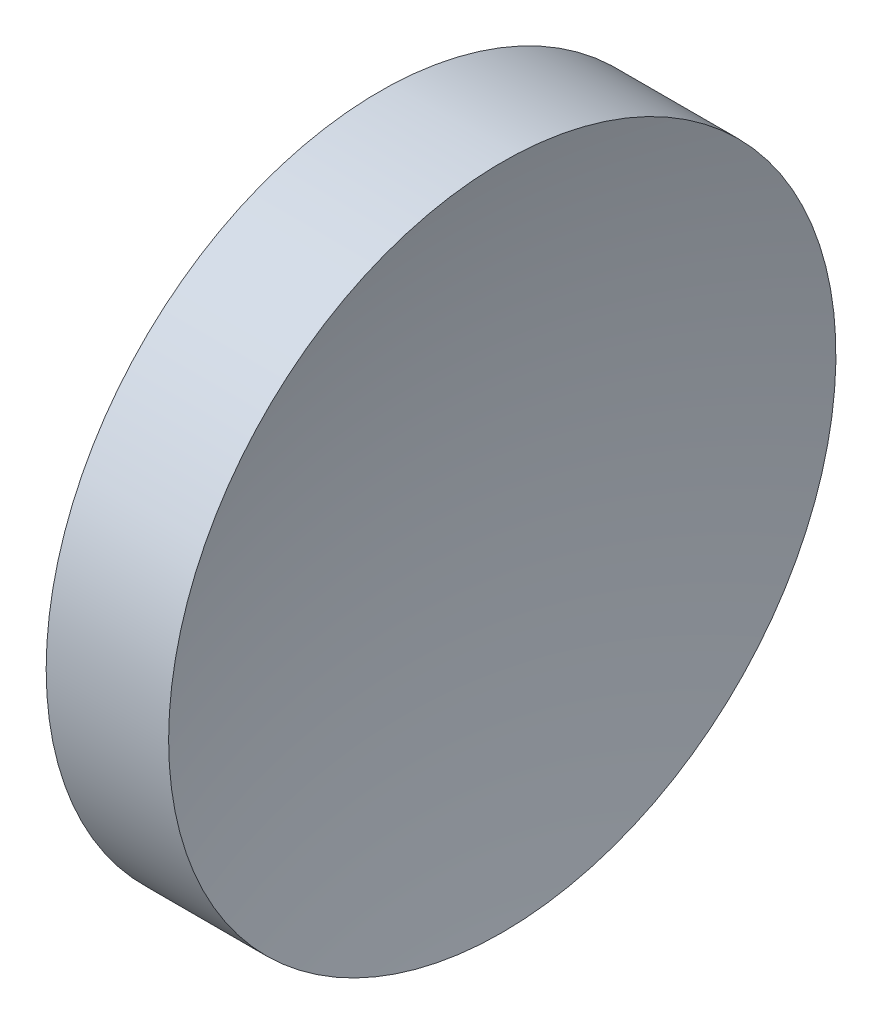
ISO-10303-21;
HEADER;
FILE_DESCRIPTION(('STEP AP214'),'2;1');
FILE_NAME('part.step','',(''),(''),'','','');
FILE_SCHEMA(('AUTOMOTIVE_DESIGN { 1 0 10303 214 1 1 1 1 }'));
ENDSEC;
DATA;
#1=APPLICATION_CONTEXT('core data for automotive mechanical design processes');
#2=APPLICATION_PROTOCOL_DEFINITION('international standard','automotive_design',2000,#1);
#3=PRODUCT_CONTEXT('',#1,'mechanical');
#4=PRODUCT('Part','Part','',(#3));
#5=PRODUCT_RELATED_PRODUCT_CATEGORY('part','',(#4));
#6=PRODUCT_DEFINITION_FORMATION('','',#4);
#7=PRODUCT_DEFINITION_CONTEXT('part definition',#1,'design');
#8=PRODUCT_DEFINITION('design','',#6,#7);
#9=PRODUCT_DEFINITION_SHAPE('','',#8);
#10=(LENGTH_UNIT() NAMED_UNIT(*) SI_UNIT(.MILLI.,.METRE.));
#11=(NAMED_UNIT(*) PLANE_ANGLE_UNIT() SI_UNIT($,.RADIAN.));
#12=(NAMED_UNIT(*) SI_UNIT($,.STERADIAN.) SOLID_ANGLE_UNIT());
#13=UNCERTAINTY_MEASURE_WITH_UNIT(LENGTH_MEASURE(1.E-05),#10,'distance_accuracy_value','');
#14=(GEOMETRIC_REPRESENTATION_CONTEXT(3) GLOBAL_UNCERTAINTY_ASSIGNED_CONTEXT((#13)) GLOBAL_UNIT_ASSIGNED_CONTEXT((#10,
#11,#12)) REPRESENTATION_CONTEXT('',''));
#15=CARTESIAN_POINT('',(0.,0.,0.));
#16=DIRECTION('',(0.,0.,1.));
#17=DIRECTION('',(1.,0.,0.));
#18=AXIS2_PLACEMENT_3D('',#15,#16,#17);
#19=CARTESIAN_POINT('',(389.199611905266,138.756042246745,0.));
#20=DIRECTION('',(-1.,0.,0.));
#21=DIRECTION('',(0.,-1.,0.));
#22=AXIS2_PLACEMENT_3D('',#19,#20,#21);
#23=SPHERICAL_SURFACE('',#22,150.);
#24=CARTESIAN_POINT('',(243.962736422488,138.756042246745,0.));
#25=DIRECTION('',(-1.,0.,0.));
#26=DIRECTION('',(0.,0.,1.));
#27=AXIS2_PLACEMENT_3D('',#24,#25,#26);
#28=CIRCLE('',#27,37.5);
#29=CARTESIAN_POINT('',(243.962736422488,138.756042246745,37.5));
#30=VERTEX_POINT('',#29);
#31=EDGE_CURVE('E10',#30,#30,#28,.T.);
#32=ORIENTED_EDGE('',*,*,#31,.F.);
#33=EDGE_LOOP('',(#32));
#34=FACE_BOUND('',#33,.T.);
#35=ADVANCED_FACE('F35',(#34),#23,.F.);
#36=CARTESIAN_POINT('',(217.97028600433,138.756042246745,0.));
#37=DIRECTION('',(-1.,0.,0.));
#38=DIRECTION('',(0.,0.,1.));
#39=AXIS2_PLACEMENT_3D('',#36,#37,#38);
#40=CYLINDRICAL_SURFACE('',#39,37.5);
#41=CARTESIAN_POINT('',(230.199611905266,138.756042246745,0.));
#42=DIRECTION('',(-1.,0.,0.));
#43=DIRECTION('',(0.,0.,1.));
#44=AXIS2_PLACEMENT_3D('',#41,#42,#43);
#45=CIRCLE('',#44,37.5);
#46=CARTESIAN_POINT('',(230.199611905266,138.756042246745,37.5));
#47=VERTEX_POINT('',#46);
#48=EDGE_CURVE('E41',#47,#47,#45,.T.);
#49=ORIENTED_EDGE('',*,*,#48,.F.);
#50=EDGE_LOOP('',(#49));
#51=FACE_BOUND('',#50,.T.);
#52=ORIENTED_EDGE('',*,*,#31,.T.);
#53=EDGE_LOOP('',(#52));
#54=FACE_BOUND('',#53,.T.);
#55=ADVANCED_FACE('F49',(#51,#54),#40,.T.);
#56=CARTESIAN_POINT('',(230.199611905266,138.756042246745,0.));
#57=DIRECTION('',(1.,0.,0.));
#58=DIRECTION('',(0.,0.,-1.));
#59=AXIS2_PLACEMENT_3D('',#56,#57,#58);
#60=PLANE('',#59);
#61=ORIENTED_EDGE('',*,*,#48,.T.);
#62=EDGE_LOOP('',(#61));
#63=FACE_BOUND('',#62,.T.);
#64=ADVANCED_FACE('F47',(#63),#60,.F.);
#65=CLOSED_SHELL('',(#35,#55,#64));
#66=MANIFOLD_SOLID_BREP('B2',#65);
#67=ADVANCED_BREP_SHAPE_REPRESENTATION('',(#18,#66),#14);
#68=SHAPE_DEFINITION_REPRESENTATION(#9,#67);
ENDSEC;
END-ISO-10303-21;
